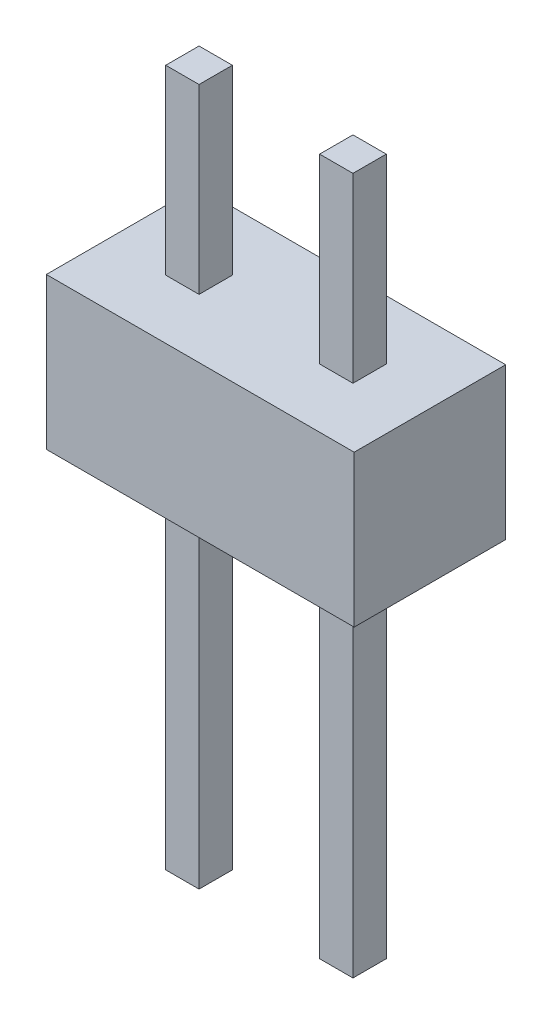
ISO-10303-21;
HEADER;
FILE_DESCRIPTION(('STEP AP214'),'2;1');
FILE_NAME('part.step','',(''),(''),'','','');
FILE_SCHEMA(('AUTOMOTIVE_DESIGN { 1 0 10303 214 1 1 1 1 }'));
ENDSEC;
DATA;
#1=APPLICATION_CONTEXT('core data for automotive mechanical design processes');
#2=APPLICATION_PROTOCOL_DEFINITION('international standard','automotive_design',2000,#1);
#3=PRODUCT_CONTEXT('',#1,'mechanical');
#4=PRODUCT('Part','Part','',(#3));
#5=PRODUCT_RELATED_PRODUCT_CATEGORY('part','',(#4));
#6=PRODUCT_DEFINITION_FORMATION('','',#4);
#7=PRODUCT_DEFINITION_CONTEXT('part definition',#1,'design');
#8=PRODUCT_DEFINITION('design','',#6,#7);
#9=PRODUCT_DEFINITION_SHAPE('','',#8);
#10=(LENGTH_UNIT() NAMED_UNIT(*) SI_UNIT(.MILLI.,.METRE.));
#11=(NAMED_UNIT(*) PLANE_ANGLE_UNIT() SI_UNIT($,.RADIAN.));
#12=(NAMED_UNIT(*) SI_UNIT($,.STERADIAN.) SOLID_ANGLE_UNIT());
#13=UNCERTAINTY_MEASURE_WITH_UNIT(LENGTH_MEASURE(1.E-05),#10,'distance_accuracy_value','');
#14=(GEOMETRIC_REPRESENTATION_CONTEXT(3) GLOBAL_UNCERTAINTY_ASSIGNED_CONTEXT((#13)) GLOBAL_UNIT_ASSIGNED_CONTEXT((#10,
#11,#12)) REPRESENTATION_CONTEXT('',''));
#15=CARTESIAN_POINT('',(0.,0.,0.));
#16=DIRECTION('',(0.,0.,1.));
#17=DIRECTION('',(1.,0.,0.));
#18=AXIS2_PLACEMENT_3D('',#15,#16,#17);
#19=CARTESIAN_POINT('',(4.085,5.5,-0.275));
#20=DIRECTION('',(1.,0.,0.));
#21=DIRECTION('',(0.,0.,-1.));
#22=AXIS2_PLACEMENT_3D('',#19,#20,#21);
#23=PLANE('',#22);
#24=DIRECTION('',(0.,0.,1.));
#25=VECTOR('',#24,1.);
#26=CARTESIAN_POINT('',(4.085,0.,-0.275));
#27=LINE('',#26,#25);
#28=CARTESIAN_POINT('',(4.085,0.,-0.275));
#29=VERTEX_POINT('',#28);
#30=CARTESIAN_POINT('',(4.085,0.,0.275));
#31=VERTEX_POINT('',#30);
#32=EDGE_CURVE('E107',#29,#31,#27,.T.);
#33=ORIENTED_EDGE('',*,*,#32,.F.);
#34=DIRECTION('',(0.,-1.,0.));
#35=VECTOR('',#34,1.);
#36=CARTESIAN_POINT('',(4.085,5.5,-0.275));
#37=LINE('',#36,#35);
#38=CARTESIAN_POINT('',(4.085,5.5,-0.275));
#39=VERTEX_POINT('',#38);
#40=EDGE_CURVE('E12',#39,#29,#37,.T.);
#41=ORIENTED_EDGE('',*,*,#40,.F.);
#42=DIRECTION('',(0.,0.,1.));
#43=VECTOR('',#42,1.);
#44=CARTESIAN_POINT('',(4.085,5.5,-0.275));
#45=LINE('',#44,#43);
#46=CARTESIAN_POINT('',(4.085,5.5,0.275));
#47=VERTEX_POINT('',#46);
#48=EDGE_CURVE('E101',#39,#47,#45,.T.);
#49=ORIENTED_EDGE('',*,*,#48,.T.);
#50=DIRECTION('',(0.,-1.,0.));
#51=VECTOR('',#50,1.);
#52=CARTESIAN_POINT('',(4.085,5.5,0.275));
#53=LINE('',#52,#51);
#54=EDGE_CURVE('E46',#47,#31,#53,.T.);
#55=ORIENTED_EDGE('',*,*,#54,.T.);
#56=EDGE_LOOP('',(#33,#41,#49,#55));
#57=FACE_BOUND('',#56,.T.);
#58=ADVANCED_FACE('F43',(#57),#23,.T.);
#59=CARTESIAN_POINT('',(3.535,5.5,-0.275));
#60=DIRECTION('',(0.,0.,-1.));
#61=DIRECTION('',(-1.,0.,0.));
#62=AXIS2_PLACEMENT_3D('',#59,#60,#61);
#63=PLANE('',#62);
#64=DIRECTION('',(1.,0.,0.));
#65=VECTOR('',#64,1.);
#66=CARTESIAN_POINT('',(3.535,0.,-0.275));
#67=LINE('',#66,#65);
#68=CARTESIAN_POINT('',(3.535,0.,-0.275));
#69=VERTEX_POINT('',#68);
#70=EDGE_CURVE('E103',#69,#29,#67,.T.);
#71=ORIENTED_EDGE('',*,*,#70,.F.);
#72=DIRECTION('',(0.,-1.,0.));
#73=VECTOR('',#72,1.);
#74=CARTESIAN_POINT('',(3.535,5.5,-0.275));
#75=LINE('',#74,#73);
#76=CARTESIAN_POINT('',(3.535,5.5,-0.275));
#77=VERTEX_POINT('',#76);
#78=EDGE_CURVE('E52',#77,#69,#75,.T.);
#79=ORIENTED_EDGE('',*,*,#78,.F.);
#80=DIRECTION('',(1.,0.,0.));
#81=VECTOR('',#80,1.);
#82=CARTESIAN_POINT('',(3.535,5.5,-0.275));
#83=LINE('',#82,#81);
#84=EDGE_CURVE('E98',#77,#39,#83,.T.);
#85=ORIENTED_EDGE('',*,*,#84,.T.);
#86=ORIENTED_EDGE('',*,*,#40,.T.);
#87=EDGE_LOOP('',(#71,#79,#85,#86));
#88=FACE_BOUND('',#87,.T.);
#89=ADVANCED_FACE('F117',(#88),#63,.T.);
#90=CARTESIAN_POINT('',(3.535,5.5,-0.275));
#91=DIRECTION('',(-1.,0.,0.));
#92=DIRECTION('',(0.,0.,1.));
#93=AXIS2_PLACEMENT_3D('',#90,#91,#92);
#94=PLANE('',#93);
#95=DIRECTION('',(0.,0.,-1.));
#96=VECTOR('',#95,1.);
#97=CARTESIAN_POINT('',(3.535,0.,-0.275));
#98=LINE('',#97,#96);
#99=CARTESIAN_POINT('',(3.535,0.,0.275));
#100=VERTEX_POINT('',#99);
#101=EDGE_CURVE('E93',#100,#69,#98,.T.);
#102=ORIENTED_EDGE('',*,*,#101,.F.);
#103=DIRECTION('',(0.,-1.,0.));
#104=VECTOR('',#103,1.);
#105=CARTESIAN_POINT('',(3.535,5.5,0.275));
#106=LINE('',#105,#104);
#107=CARTESIAN_POINT('',(3.535,5.5,0.275));
#108=VERTEX_POINT('',#107);
#109=EDGE_CURVE('E88',#108,#100,#106,.T.);
#110=ORIENTED_EDGE('',*,*,#109,.F.);
#111=DIRECTION('',(0.,0.,-1.));
#112=VECTOR('',#111,1.);
#113=CARTESIAN_POINT('',(3.535,5.5,-0.275));
#114=LINE('',#113,#112);
#115=EDGE_CURVE('E91',#108,#77,#114,.T.);
#116=ORIENTED_EDGE('',*,*,#115,.T.);
#117=ORIENTED_EDGE('',*,*,#78,.T.);
#118=EDGE_LOOP('',(#102,#110,#116,#117));
#119=FACE_BOUND('',#118,.T.);
#120=ADVANCED_FACE('F90',(#119),#94,.T.);
#121=CARTESIAN_POINT('',(3.535,5.5,0.275));
#122=DIRECTION('',(0.,0.,1.));
#123=DIRECTION('',(1.,0.,0.));
#124=AXIS2_PLACEMENT_3D('',#121,#122,#123);
#125=PLANE('',#124);
#126=DIRECTION('',(-1.,0.,0.));
#127=VECTOR('',#126,1.);
#128=CARTESIAN_POINT('',(3.535,0.,0.275));
#129=LINE('',#128,#127);
#130=EDGE_CURVE('E110',#31,#100,#129,.T.);
#131=ORIENTED_EDGE('',*,*,#130,.F.);
#132=ORIENTED_EDGE('',*,*,#54,.F.);
#133=DIRECTION('',(-1.,0.,0.));
#134=VECTOR('',#133,1.);
#135=CARTESIAN_POINT('',(3.535,5.5,0.275));
#136=LINE('',#135,#134);
#137=EDGE_CURVE('E97',#47,#108,#136,.T.);
#138=ORIENTED_EDGE('',*,*,#137,.T.);
#139=ORIENTED_EDGE('',*,*,#109,.T.);
#140=EDGE_LOOP('',(#131,#132,#138,#139));
#141=FACE_BOUND('',#140,.T.);
#142=ADVANCED_FACE('F100',(#141),#125,.T.);
#143=CARTESIAN_POINT('',(0.,5.5,0.));
#144=DIRECTION('',(0.,1.,0.));
#145=DIRECTION('',(0.,0.,1.));
#146=AXIS2_PLACEMENT_3D('',#143,#144,#145);
#147=PLANE('',#146);
#148=ORIENTED_EDGE('',*,*,#48,.F.);
#149=ORIENTED_EDGE('',*,*,#84,.F.);
#150=ORIENTED_EDGE('',*,*,#115,.F.);
#151=ORIENTED_EDGE('',*,*,#137,.F.);
#152=EDGE_LOOP('',(#148,#149,#150,#151));
#153=FACE_BOUND('',#152,.T.);
#154=ADVANCED_FACE('F96',(#153),#147,.T.);
#155=CARTESIAN_POINT('',(0.,0.,0.));
#156=DIRECTION('',(0.,1.,0.));
#157=DIRECTION('',(0.,0.,1.));
#158=AXIS2_PLACEMENT_3D('',#155,#156,#157);
#159=PLANE('',#158);
#160=ORIENTED_EDGE('',*,*,#32,.T.);
#161=ORIENTED_EDGE('',*,*,#130,.T.);
#162=ORIENTED_EDGE('',*,*,#101,.T.);
#163=ORIENTED_EDGE('',*,*,#70,.T.);
#164=EDGE_LOOP('',(#160,#161,#162,#163));
#165=FACE_BOUND('',#164,.T.);
#166=ADVANCED_FACE('F116',(#165),#159,.F.);
#167=CLOSED_SHELL('',(#58,#89,#120,#142,#154,#166));
#168=MANIFOLD_SOLID_BREP('B2',#167);
#169=CARTESIAN_POINT('',(1.545,5.5,-0.275));
#170=DIRECTION('',(1.,0.,0.));
#171=DIRECTION('',(0.,0.,-1.));
#172=AXIS2_PLACEMENT_3D('',#169,#170,#171);
#173=PLANE('',#172);
#174=DIRECTION('',(0.,0.,1.));
#175=VECTOR('',#174,1.);
#176=CARTESIAN_POINT('',(1.545,0.,-0.275));
#177=LINE('',#176,#175);
#178=CARTESIAN_POINT('',(1.545,0.,-0.275));
#179=VERTEX_POINT('',#178);
#180=CARTESIAN_POINT('',(1.545,0.,0.275));
#181=VERTEX_POINT('',#180);
#182=EDGE_CURVE('E240',#179,#181,#177,.T.);
#183=ORIENTED_EDGE('',*,*,#182,.F.);
#184=DIRECTION('',(0.,-1.,0.));
#185=VECTOR('',#184,1.);
#186=CARTESIAN_POINT('',(1.545,5.5,-0.275));
#187=LINE('',#186,#185);
#188=CARTESIAN_POINT('',(1.545,5.5,-0.275));
#189=VERTEX_POINT('',#188);
#190=EDGE_CURVE('E41',#189,#179,#187,.T.);
#191=ORIENTED_EDGE('',*,*,#190,.F.);
#192=DIRECTION('',(0.,0.,1.));
#193=VECTOR('',#192,1.);
#194=CARTESIAN_POINT('',(1.545,5.5,-0.275));
#195=LINE('',#194,#193);
#196=CARTESIAN_POINT('',(1.545,5.5,0.275));
#197=VERTEX_POINT('',#196);
#198=EDGE_CURVE('E234',#189,#197,#195,.T.);
#199=ORIENTED_EDGE('',*,*,#198,.T.);
#200=DIRECTION('',(0.,-1.,0.));
#201=VECTOR('',#200,1.);
#202=CARTESIAN_POINT('',(1.545,5.5,0.275));
#203=LINE('',#202,#201);
#204=EDGE_CURVE('E179',#197,#181,#203,.T.);
#205=ORIENTED_EDGE('',*,*,#204,.T.);
#206=EDGE_LOOP('',(#183,#191,#199,#205));
#207=FACE_BOUND('',#206,.T.);
#208=ADVANCED_FACE('F176',(#207),#173,.T.);
#209=CARTESIAN_POINT('',(0.995,5.5,-0.275));
#210=DIRECTION('',(0.,0.,-1.));
#211=DIRECTION('',(-1.,0.,0.));
#212=AXIS2_PLACEMENT_3D('',#209,#210,#211);
#213=PLANE('',#212);
#214=DIRECTION('',(1.,0.,0.));
#215=VECTOR('',#214,1.);
#216=CARTESIAN_POINT('',(0.995,0.,-0.275));
#217=LINE('',#216,#215);
#218=CARTESIAN_POINT('',(0.995,0.,-0.275));
#219=VERTEX_POINT('',#218);
#220=EDGE_CURVE('E236',#219,#179,#217,.T.);
#221=ORIENTED_EDGE('',*,*,#220,.F.);
#222=DIRECTION('',(0.,-1.,0.));
#223=VECTOR('',#222,1.);
#224=CARTESIAN_POINT('',(0.995,5.5,-0.275));
#225=LINE('',#224,#223);
#226=CARTESIAN_POINT('',(0.995,5.5,-0.275));
#227=VERTEX_POINT('',#226);
#228=EDGE_CURVE('E185',#227,#219,#225,.T.);
#229=ORIENTED_EDGE('',*,*,#228,.F.);
#230=DIRECTION('',(1.,0.,0.));
#231=VECTOR('',#230,1.);
#232=CARTESIAN_POINT('',(0.995,5.5,-0.275));
#233=LINE('',#232,#231);
#234=EDGE_CURVE('E231',#227,#189,#233,.T.);
#235=ORIENTED_EDGE('',*,*,#234,.T.);
#236=ORIENTED_EDGE('',*,*,#190,.T.);
#237=EDGE_LOOP('',(#221,#229,#235,#236));
#238=FACE_BOUND('',#237,.T.);
#239=ADVANCED_FACE('F250',(#238),#213,.T.);
#240=CARTESIAN_POINT('',(0.995,5.5,-0.275));
#241=DIRECTION('',(-1.,0.,0.));
#242=DIRECTION('',(0.,0.,1.));
#243=AXIS2_PLACEMENT_3D('',#240,#241,#242);
#244=PLANE('',#243);
#245=DIRECTION('',(0.,0.,-1.));
#246=VECTOR('',#245,1.);
#247=CARTESIAN_POINT('',(0.995,0.,-0.275));
#248=LINE('',#247,#246);
#249=CARTESIAN_POINT('',(0.995,0.,0.275));
#250=VERTEX_POINT('',#249);
#251=EDGE_CURVE('E226',#250,#219,#248,.T.);
#252=ORIENTED_EDGE('',*,*,#251,.F.);
#253=DIRECTION('',(0.,-1.,0.));
#254=VECTOR('',#253,1.);
#255=CARTESIAN_POINT('',(0.995,5.5,0.275));
#256=LINE('',#255,#254);
#257=CARTESIAN_POINT('',(0.995,5.5,0.275));
#258=VERTEX_POINT('',#257);
#259=EDGE_CURVE('E221',#258,#250,#256,.T.);
#260=ORIENTED_EDGE('',*,*,#259,.F.);
#261=DIRECTION('',(0.,0.,-1.));
#262=VECTOR('',#261,1.);
#263=CARTESIAN_POINT('',(0.995,5.5,-0.275));
#264=LINE('',#263,#262);
#265=EDGE_CURVE('E224',#258,#227,#264,.T.);
#266=ORIENTED_EDGE('',*,*,#265,.T.);
#267=ORIENTED_EDGE('',*,*,#228,.T.);
#268=EDGE_LOOP('',(#252,#260,#266,#267));
#269=FACE_BOUND('',#268,.T.);
#270=ADVANCED_FACE('F223',(#269),#244,.T.);
#271=CARTESIAN_POINT('',(0.995,5.5,0.275));
#272=DIRECTION('',(0.,0.,1.));
#273=DIRECTION('',(1.,0.,0.));
#274=AXIS2_PLACEMENT_3D('',#271,#272,#273);
#275=PLANE('',#274);
#276=DIRECTION('',(-1.,0.,0.));
#277=VECTOR('',#276,1.);
#278=CARTESIAN_POINT('',(0.995,0.,0.275));
#279=LINE('',#278,#277);
#280=EDGE_CURVE('E243',#181,#250,#279,.T.);
#281=ORIENTED_EDGE('',*,*,#280,.F.);
#282=ORIENTED_EDGE('',*,*,#204,.F.);
#283=DIRECTION('',(-1.,0.,0.));
#284=VECTOR('',#283,1.);
#285=CARTESIAN_POINT('',(0.995,5.5,0.275));
#286=LINE('',#285,#284);
#287=EDGE_CURVE('E230',#197,#258,#286,.T.);
#288=ORIENTED_EDGE('',*,*,#287,.T.);
#289=ORIENTED_EDGE('',*,*,#259,.T.);
#290=EDGE_LOOP('',(#281,#282,#288,#289));
#291=FACE_BOUND('',#290,.T.);
#292=ADVANCED_FACE('F233',(#291),#275,.T.);
#293=CARTESIAN_POINT('',(0.,5.5,0.));
#294=DIRECTION('',(0.,1.,0.));
#295=DIRECTION('',(0.,0.,1.));
#296=AXIS2_PLACEMENT_3D('',#293,#294,#295);
#297=PLANE('',#296);
#298=ORIENTED_EDGE('',*,*,#198,.F.);
#299=ORIENTED_EDGE('',*,*,#234,.F.);
#300=ORIENTED_EDGE('',*,*,#265,.F.);
#301=ORIENTED_EDGE('',*,*,#287,.F.);
#302=EDGE_LOOP('',(#298,#299,#300,#301));
#303=FACE_BOUND('',#302,.T.);
#304=ADVANCED_FACE('F229',(#303),#297,.T.);
#305=CARTESIAN_POINT('',(0.,0.,0.));
#306=DIRECTION('',(0.,1.,0.));
#307=DIRECTION('',(0.,0.,1.));
#308=AXIS2_PLACEMENT_3D('',#305,#306,#307);
#309=PLANE('',#308);
#310=ORIENTED_EDGE('',*,*,#182,.T.);
#311=ORIENTED_EDGE('',*,*,#280,.T.);
#312=ORIENTED_EDGE('',*,*,#251,.T.);
#313=ORIENTED_EDGE('',*,*,#220,.T.);
#314=EDGE_LOOP('',(#310,#311,#312,#313));
#315=FACE_BOUND('',#314,.T.);
#316=ADVANCED_FACE('F249',(#315),#309,.F.);
#317=CLOSED_SHELL('',(#208,#239,#270,#292,#304,#316));
#318=MANIFOLD_SOLID_BREP('B6',#317);
#319=CARTESIAN_POINT('',(4.085,-6.,-0.275));
#320=DIRECTION('',(-1.,0.,0.));
#321=DIRECTION('',(0.,0.,1.));
#322=AXIS2_PLACEMENT_3D('',#319,#320,#321);
#323=PLANE('',#322);
#324=DIRECTION('',(0.,0.,1.));
#325=VECTOR('',#324,1.);
#326=CARTESIAN_POINT('',(4.085,0.,-0.275));
#327=LINE('',#326,#325);
#328=CARTESIAN_POINT('',(4.085,0.,-0.275));
#329=VERTEX_POINT('',#328);
#330=CARTESIAN_POINT('',(4.085,0.,0.275));
#331=VERTEX_POINT('',#330);
#332=EDGE_CURVE('E372',#329,#331,#327,.T.);
#333=ORIENTED_EDGE('',*,*,#332,.T.);
#334=DIRECTION('',(0.,1.,0.));
#335=VECTOR('',#334,1.);
#336=CARTESIAN_POINT('',(4.085,-6.,0.275));
#337=LINE('',#336,#335);
#338=CARTESIAN_POINT('',(4.085,-6.,0.275));
#339=VERTEX_POINT('',#338);
#340=EDGE_CURVE('E174',#339,#331,#337,.T.);
#341=ORIENTED_EDGE('',*,*,#340,.F.);
#342=DIRECTION('',(0.,0.,1.));
#343=VECTOR('',#342,1.);
#344=CARTESIAN_POINT('',(4.085,-6.,-0.275));
#345=LINE('',#344,#343);
#346=CARTESIAN_POINT('',(4.085,-6.,-0.275));
#347=VERTEX_POINT('',#346);
#348=EDGE_CURVE('E360',#347,#339,#345,.T.);
#349=ORIENTED_EDGE('',*,*,#348,.F.);
#350=DIRECTION('',(0.,1.,0.));
#351=VECTOR('',#350,1.);
#352=CARTESIAN_POINT('',(4.085,-6.,-0.275));
#353=LINE('',#352,#351);
#354=EDGE_CURVE('E368',#347,#329,#353,.T.);
#355=ORIENTED_EDGE('',*,*,#354,.T.);
#356=EDGE_LOOP('',(#333,#341,#349,#355));
#357=FACE_BOUND('',#356,.T.);
#358=ADVANCED_FACE('F309',(#357),#323,.F.);
#359=CARTESIAN_POINT('',(3.535,-6.,0.275));
#360=DIRECTION('',(0.,0.,-1.));
#361=DIRECTION('',(-1.,0.,0.));
#362=AXIS2_PLACEMENT_3D('',#359,#360,#361);
#363=PLANE('',#362);
#364=DIRECTION('',(-1.,0.,0.));
#365=VECTOR('',#364,1.);
#366=CARTESIAN_POINT('',(3.535,0.,0.275));
#367=LINE('',#366,#365);
#368=CARTESIAN_POINT('',(3.535,0.,0.275));
#369=VERTEX_POINT('',#368);
#370=EDGE_CURVE('E364',#331,#369,#367,.T.);
#371=ORIENTED_EDGE('',*,*,#370,.T.);
#372=DIRECTION('',(0.,1.,0.));
#373=VECTOR('',#372,1.);
#374=CARTESIAN_POINT('',(3.535,-6.,0.275));
#375=LINE('',#374,#373);
#376=CARTESIAN_POINT('',(3.535,-6.,0.275));
#377=VERTEX_POINT('',#376);
#378=EDGE_CURVE('E317',#377,#369,#375,.T.);
#379=ORIENTED_EDGE('',*,*,#378,.F.);
#380=DIRECTION('',(-1.,0.,0.));
#381=VECTOR('',#380,1.);
#382=CARTESIAN_POINT('',(3.535,-6.,0.275));
#383=LINE('',#382,#381);
#384=EDGE_CURVE('E355',#339,#377,#383,.T.);
#385=ORIENTED_EDGE('',*,*,#384,.F.);
#386=ORIENTED_EDGE('',*,*,#340,.T.);
#387=EDGE_LOOP('',(#371,#379,#385,#386));
#388=FACE_BOUND('',#387,.T.);
#389=ADVANCED_FACE('F363',(#388),#363,.F.);
#390=CARTESIAN_POINT('',(3.535,-6.,-0.275));
#391=DIRECTION('',(1.,0.,0.));
#392=DIRECTION('',(0.,0.,-1.));
#393=AXIS2_PLACEMENT_3D('',#390,#391,#392);
#394=PLANE('',#393);
#395=DIRECTION('',(0.,0.,-1.));
#396=VECTOR('',#395,1.);
#397=CARTESIAN_POINT('',(3.535,0.,-0.275));
#398=LINE('',#397,#396);
#399=CARTESIAN_POINT('',(3.535,0.,-0.275));
#400=VERTEX_POINT('',#399);
#401=EDGE_CURVE('E342',#369,#400,#398,.T.);
#402=ORIENTED_EDGE('',*,*,#401,.T.);
#403=DIRECTION('',(0.,1.,0.));
#404=VECTOR('',#403,1.);
#405=CARTESIAN_POINT('',(3.535,-6.,-0.275));
#406=LINE('',#405,#404);
#407=CARTESIAN_POINT('',(3.535,-6.,-0.275));
#408=VERTEX_POINT('',#407);
#409=EDGE_CURVE('E365',#408,#400,#406,.T.);
#410=ORIENTED_EDGE('',*,*,#409,.F.);
#411=DIRECTION('',(0.,0.,-1.));
#412=VECTOR('',#411,1.);
#413=CARTESIAN_POINT('',(3.535,-6.,-0.275));
#414=LINE('',#413,#412);
#415=EDGE_CURVE('E358',#377,#408,#414,.T.);
#416=ORIENTED_EDGE('',*,*,#415,.F.);
#417=ORIENTED_EDGE('',*,*,#378,.T.);
#418=EDGE_LOOP('',(#402,#410,#416,#417));
#419=FACE_BOUND('',#418,.T.);
#420=ADVANCED_FACE('F366',(#419),#394,.F.);
#421=CARTESIAN_POINT('',(3.535,-6.,-0.275));
#422=DIRECTION('',(0.,0.,1.));
#423=DIRECTION('',(1.,0.,0.));
#424=AXIS2_PLACEMENT_3D('',#421,#422,#423);
#425=PLANE('',#424);
#426=DIRECTION('',(1.,0.,0.));
#427=VECTOR('',#426,1.);
#428=CARTESIAN_POINT('',(3.535,0.,-0.275));
#429=LINE('',#428,#427);
#430=EDGE_CURVE('E348',#400,#329,#429,.T.);
#431=ORIENTED_EDGE('',*,*,#430,.T.);
#432=ORIENTED_EDGE('',*,*,#354,.F.);
#433=DIRECTION('',(1.,0.,0.));
#434=VECTOR('',#433,1.);
#435=CARTESIAN_POINT('',(3.535,-6.,-0.275));
#436=LINE('',#435,#434);
#437=EDGE_CURVE('E325',#408,#347,#436,.T.);
#438=ORIENTED_EDGE('',*,*,#437,.F.);
#439=ORIENTED_EDGE('',*,*,#409,.T.);
#440=EDGE_LOOP('',(#431,#432,#438,#439));
#441=FACE_BOUND('',#440,.T.);
#442=ADVANCED_FACE('F379',(#441),#425,.F.);
#443=CARTESIAN_POINT('',(0.,-6.,0.));
#444=DIRECTION('',(0.,1.,0.));
#445=DIRECTION('',(0.,0.,1.));
#446=AXIS2_PLACEMENT_3D('',#443,#444,#445);
#447=PLANE('',#446);
#448=ORIENTED_EDGE('',*,*,#348,.T.);
#449=ORIENTED_EDGE('',*,*,#384,.T.);
#450=ORIENTED_EDGE('',*,*,#415,.T.);
#451=ORIENTED_EDGE('',*,*,#437,.T.);
#452=EDGE_LOOP('',(#448,#449,#450,#451));
#453=FACE_BOUND('',#452,.T.);
#454=ADVANCED_FACE('F356',(#453),#447,.F.);
#455=CARTESIAN_POINT('',(0.,0.,0.));
#456=DIRECTION('',(0.,1.,0.));
#457=DIRECTION('',(0.,0.,1.));
#458=AXIS2_PLACEMENT_3D('',#455,#456,#457);
#459=PLANE('',#458);
#460=ORIENTED_EDGE('',*,*,#332,.F.);
#461=ORIENTED_EDGE('',*,*,#430,.F.);
#462=ORIENTED_EDGE('',*,*,#401,.F.);
#463=ORIENTED_EDGE('',*,*,#370,.F.);
#464=EDGE_LOOP('',(#460,#461,#462,#463));
#465=FACE_BOUND('',#464,.T.);
#466=ADVANCED_FACE('F382',(#465),#459,.T.);
#467=CLOSED_SHELL('',(#358,#389,#420,#442,#454,#466));
#468=MANIFOLD_SOLID_BREP('B35',#467);
#469=CARTESIAN_POINT('',(1.545,-6.,-0.275));
#470=DIRECTION('',(-1.,0.,0.));
#471=DIRECTION('',(0.,0.,1.));
#472=AXIS2_PLACEMENT_3D('',#469,#470,#471);
#473=PLANE('',#472);
#474=DIRECTION('',(0.,0.,1.));
#475=VECTOR('',#474,1.);
#476=CARTESIAN_POINT('',(1.545,0.,-0.275));
#477=LINE('',#476,#475);
#478=CARTESIAN_POINT('',(1.545,0.,-0.275));
#479=VERTEX_POINT('',#478);
#480=CARTESIAN_POINT('',(1.545,0.,0.275));
#481=VERTEX_POINT('',#480);
#482=EDGE_CURVE('E504',#479,#481,#477,.T.);
#483=ORIENTED_EDGE('',*,*,#482,.T.);
#484=DIRECTION('',(0.,1.,0.));
#485=VECTOR('',#484,1.);
#486=CARTESIAN_POINT('',(1.545,-6.,0.275));
#487=LINE('',#486,#485);
#488=CARTESIAN_POINT('',(1.545,-6.,0.275));
#489=VERTEX_POINT('',#488);
#490=EDGE_CURVE('E307',#489,#481,#487,.T.);
#491=ORIENTED_EDGE('',*,*,#490,.F.);
#492=DIRECTION('',(0.,0.,1.));
#493=VECTOR('',#492,1.);
#494=CARTESIAN_POINT('',(1.545,-6.,-0.275));
#495=LINE('',#494,#493);
#496=CARTESIAN_POINT('',(1.545,-6.,-0.275));
#497=VERTEX_POINT('',#496);
#498=EDGE_CURVE('E492',#497,#489,#495,.T.);
#499=ORIENTED_EDGE('',*,*,#498,.F.);
#500=DIRECTION('',(0.,1.,0.));
#501=VECTOR('',#500,1.);
#502=CARTESIAN_POINT('',(1.545,-6.,-0.275));
#503=LINE('',#502,#501);
#504=EDGE_CURVE('E500',#497,#479,#503,.T.);
#505=ORIENTED_EDGE('',*,*,#504,.T.);
#506=EDGE_LOOP('',(#483,#491,#499,#505));
#507=FACE_BOUND('',#506,.T.);
#508=ADVANCED_FACE('F441',(#507),#473,.F.);
#509=CARTESIAN_POINT('',(0.995,-6.,0.275));
#510=DIRECTION('',(0.,0.,-1.));
#511=DIRECTION('',(-1.,0.,0.));
#512=AXIS2_PLACEMENT_3D('',#509,#510,#511);
#513=PLANE('',#512);
#514=DIRECTION('',(-1.,0.,0.));
#515=VECTOR('',#514,1.);
#516=CARTESIAN_POINT('',(0.995,0.,0.275));
#517=LINE('',#516,#515);
#518=CARTESIAN_POINT('',(0.995,0.,0.275));
#519=VERTEX_POINT('',#518);
#520=EDGE_CURVE('E496',#481,#519,#517,.T.);
#521=ORIENTED_EDGE('',*,*,#520,.T.);
#522=DIRECTION('',(0.,1.,0.));
#523=VECTOR('',#522,1.);
#524=CARTESIAN_POINT('',(0.995,-6.,0.275));
#525=LINE('',#524,#523);
#526=CARTESIAN_POINT('',(0.995,-6.,0.275));
#527=VERTEX_POINT('',#526);
#528=EDGE_CURVE('E449',#527,#519,#525,.T.);
#529=ORIENTED_EDGE('',*,*,#528,.F.);
#530=DIRECTION('',(-1.,0.,0.));
#531=VECTOR('',#530,1.);
#532=CARTESIAN_POINT('',(0.995,-6.,0.275));
#533=LINE('',#532,#531);
#534=EDGE_CURVE('E487',#489,#527,#533,.T.);
#535=ORIENTED_EDGE('',*,*,#534,.F.);
#536=ORIENTED_EDGE('',*,*,#490,.T.);
#537=EDGE_LOOP('',(#521,#529,#535,#536));
#538=FACE_BOUND('',#537,.T.);
#539=ADVANCED_FACE('F495',(#538),#513,.F.);
#540=CARTESIAN_POINT('',(0.995,-6.,-0.275));
#541=DIRECTION('',(1.,0.,0.));
#542=DIRECTION('',(0.,0.,-1.));
#543=AXIS2_PLACEMENT_3D('',#540,#541,#542);
#544=PLANE('',#543);
#545=DIRECTION('',(0.,0.,-1.));
#546=VECTOR('',#545,1.);
#547=CARTESIAN_POINT('',(0.995,0.,-0.275));
#548=LINE('',#547,#546);
#549=CARTESIAN_POINT('',(0.995,0.,-0.275));
#550=VERTEX_POINT('',#549);
#551=EDGE_CURVE('E474',#519,#550,#548,.T.);
#552=ORIENTED_EDGE('',*,*,#551,.T.);
#553=DIRECTION('',(0.,1.,0.));
#554=VECTOR('',#553,1.);
#555=CARTESIAN_POINT('',(0.995,-6.,-0.275));
#556=LINE('',#555,#554);
#557=CARTESIAN_POINT('',(0.995,-6.,-0.275));
#558=VERTEX_POINT('',#557);
#559=EDGE_CURVE('E497',#558,#550,#556,.T.);
#560=ORIENTED_EDGE('',*,*,#559,.F.);
#561=DIRECTION('',(0.,0.,-1.));
#562=VECTOR('',#561,1.);
#563=CARTESIAN_POINT('',(0.995,-6.,-0.275));
#564=LINE('',#563,#562);
#565=EDGE_CURVE('E490',#527,#558,#564,.T.);
#566=ORIENTED_EDGE('',*,*,#565,.F.);
#567=ORIENTED_EDGE('',*,*,#528,.T.);
#568=EDGE_LOOP('',(#552,#560,#566,#567));
#569=FACE_BOUND('',#568,.T.);
#570=ADVANCED_FACE('F498',(#569),#544,.F.);
#571=CARTESIAN_POINT('',(0.995,-6.,-0.275));
#572=DIRECTION('',(0.,0.,1.));
#573=DIRECTION('',(1.,0.,0.));
#574=AXIS2_PLACEMENT_3D('',#571,#572,#573);
#575=PLANE('',#574);
#576=DIRECTION('',(1.,0.,0.));
#577=VECTOR('',#576,1.);
#578=CARTESIAN_POINT('',(0.995,0.,-0.275));
#579=LINE('',#578,#577);
#580=EDGE_CURVE('E480',#550,#479,#579,.T.);
#581=ORIENTED_EDGE('',*,*,#580,.T.);
#582=ORIENTED_EDGE('',*,*,#504,.F.);
#583=DIRECTION('',(1.,0.,0.));
#584=VECTOR('',#583,1.);
#585=CARTESIAN_POINT('',(0.995,-6.,-0.275));
#586=LINE('',#585,#584);
#587=EDGE_CURVE('E457',#558,#497,#586,.T.);
#588=ORIENTED_EDGE('',*,*,#587,.F.);
#589=ORIENTED_EDGE('',*,*,#559,.T.);
#590=EDGE_LOOP('',(#581,#582,#588,#589));
#591=FACE_BOUND('',#590,.T.);
#592=ADVANCED_FACE('F511',(#591),#575,.F.);
#593=CARTESIAN_POINT('',(0.,-6.,0.));
#594=DIRECTION('',(0.,1.,0.));
#595=DIRECTION('',(0.,0.,1.));
#596=AXIS2_PLACEMENT_3D('',#593,#594,#595);
#597=PLANE('',#596);
#598=ORIENTED_EDGE('',*,*,#498,.T.);
#599=ORIENTED_EDGE('',*,*,#534,.T.);
#600=ORIENTED_EDGE('',*,*,#565,.T.);
#601=ORIENTED_EDGE('',*,*,#587,.T.);
#602=EDGE_LOOP('',(#598,#599,#600,#601));
#603=FACE_BOUND('',#602,.T.);
#604=ADVANCED_FACE('F488',(#603),#597,.F.);
#605=CARTESIAN_POINT('',(0.,0.,0.));
#606=DIRECTION('',(0.,1.,0.));
#607=DIRECTION('',(0.,0.,1.));
#608=AXIS2_PLACEMENT_3D('',#605,#606,#607);
#609=PLANE('',#608);
#610=ORIENTED_EDGE('',*,*,#482,.F.);
#611=ORIENTED_EDGE('',*,*,#580,.F.);
#612=ORIENTED_EDGE('',*,*,#551,.F.);
#613=ORIENTED_EDGE('',*,*,#520,.F.);
#614=EDGE_LOOP('',(#610,#611,#612,#613));
#615=FACE_BOUND('',#614,.T.);
#616=ADVANCED_FACE('F514',(#615),#609,.T.);
#617=CLOSED_SHELL('',(#508,#539,#570,#592,#604,#616));
#618=MANIFOLD_SOLID_BREP('B168',#617);
#619=CARTESIAN_POINT('',(0.,0.,1.25));
#620=DIRECTION('',(1.,0.,0.));
#621=DIRECTION('',(0.,0.,-1.));
#622=AXIS2_PLACEMENT_3D('',#619,#620,#621);
#623=PLANE('',#622);
#624=DIRECTION('',(0.,-1.,0.));
#625=VECTOR('',#624,1.);
#626=CARTESIAN_POINT('',(0.,0.,-1.25));
#627=LINE('',#626,#625);
#628=CARTESIAN_POINT('',(0.,2.5,-1.25));
#629=VERTEX_POINT('',#628);
#630=CARTESIAN_POINT('',(0.,0.,-1.25));
#631=VERTEX_POINT('',#630);
#632=EDGE_CURVE('E627',#629,#631,#627,.T.);
#633=ORIENTED_EDGE('',*,*,#632,.T.);
#634=DIRECTION('',(0.,0.,-1.));
#635=VECTOR('',#634,1.);
#636=CARTESIAN_POINT('',(0.,0.,1.25));
#637=LINE('',#636,#635);
#638=CARTESIAN_POINT('',(0.,0.,1.25));
#639=VERTEX_POINT('',#638);
#640=EDGE_CURVE('E439',#639,#631,#637,.T.);
#641=ORIENTED_EDGE('',*,*,#640,.F.);
#642=DIRECTION('',(0.,-1.,0.));
#643=VECTOR('',#642,1.);
#644=CARTESIAN_POINT('',(0.,0.,1.25));
#645=LINE('',#644,#643);
#646=CARTESIAN_POINT('',(0.,2.5,1.25));
#647=VERTEX_POINT('',#646);
#648=EDGE_CURVE('E615',#647,#639,#645,.T.);
#649=ORIENTED_EDGE('',*,*,#648,.F.);
#650=DIRECTION('',(0.,0.,-1.));
#651=VECTOR('',#650,1.);
#652=CARTESIAN_POINT('',(0.,2.5,1.25));
#653=LINE('',#652,#651);
#654=EDGE_CURVE('E623',#647,#629,#653,.T.);
#655=ORIENTED_EDGE('',*,*,#654,.T.);
#656=EDGE_LOOP('',(#633,#641,#649,#655));
#657=FACE_BOUND('',#656,.T.);
#658=ADVANCED_FACE('F564',(#657),#623,.F.);
#659=CARTESIAN_POINT('',(0.,0.,1.25));
#660=DIRECTION('',(0.,1.,0.));
#661=DIRECTION('',(0.,0.,1.));
#662=AXIS2_PLACEMENT_3D('',#659,#660,#661);
#663=PLANE('',#662);
#664=DIRECTION('',(1.,0.,0.));
#665=VECTOR('',#664,1.);
#666=CARTESIAN_POINT('',(0.,0.,-1.25));
#667=LINE('',#666,#665);
#668=CARTESIAN_POINT('',(5.08,0.,-1.25));
#669=VERTEX_POINT('',#668);
#670=EDGE_CURVE('E619',#631,#669,#667,.T.);
#671=ORIENTED_EDGE('',*,*,#670,.T.);
#672=DIRECTION('',(0.,0.,-1.));
#673=VECTOR('',#672,1.);
#674=CARTESIAN_POINT('',(5.08,0.,1.25));
#675=LINE('',#674,#673);
#676=CARTESIAN_POINT('',(5.08,0.,1.25));
#677=VERTEX_POINT('',#676);
#678=EDGE_CURVE('E572',#677,#669,#675,.T.);
#679=ORIENTED_EDGE('',*,*,#678,.F.);
#680=DIRECTION('',(1.,0.,0.));
#681=VECTOR('',#680,1.);
#682=CARTESIAN_POINT('',(0.,0.,1.25));
#683=LINE('',#682,#681);
#684=EDGE_CURVE('E610',#639,#677,#683,.T.);
#685=ORIENTED_EDGE('',*,*,#684,.F.);
#686=ORIENTED_EDGE('',*,*,#640,.T.);
#687=EDGE_LOOP('',(#671,#679,#685,#686));
#688=FACE_BOUND('',#687,.T.);
#689=ADVANCED_FACE('F618',(#688),#663,.F.);
#690=CARTESIAN_POINT('',(5.08,0.,1.25));
#691=DIRECTION('',(-1.,0.,0.));
#692=DIRECTION('',(0.,0.,1.));
#693=AXIS2_PLACEMENT_3D('',#690,#691,#692);
#694=PLANE('',#693);
#695=DIRECTION('',(0.,1.,0.));
#696=VECTOR('',#695,1.);
#697=CARTESIAN_POINT('',(5.08,0.,-1.25));
#698=LINE('',#697,#696);
#699=CARTESIAN_POINT('',(5.08,2.5,-1.25));
#700=VERTEX_POINT('',#699);
#701=EDGE_CURVE('E597',#669,#700,#698,.T.);
#702=ORIENTED_EDGE('',*,*,#701,.T.);
#703=DIRECTION('',(0.,0.,-1.));
#704=VECTOR('',#703,1.);
#705=CARTESIAN_POINT('',(5.08,2.5,1.25));
#706=LINE('',#705,#704);
#707=CARTESIAN_POINT('',(5.08,2.5,1.25));
#708=VERTEX_POINT('',#707);
#709=EDGE_CURVE('E620',#708,#700,#706,.T.);
#710=ORIENTED_EDGE('',*,*,#709,.F.);
#711=DIRECTION('',(0.,1.,0.));
#712=VECTOR('',#711,1.);
#713=CARTESIAN_POINT('',(5.08,0.,1.25));
#714=LINE('',#713,#712);
#715=EDGE_CURVE('E613',#677,#708,#714,.T.);
#716=ORIENTED_EDGE('',*,*,#715,.F.);
#717=ORIENTED_EDGE('',*,*,#678,.T.);
#718=EDGE_LOOP('',(#702,#710,#716,#717));
#719=FACE_BOUND('',#718,.T.);
#720=ADVANCED_FACE('F621',(#719),#694,.F.);
#721=CARTESIAN_POINT('',(0.,2.5,1.25));
#722=DIRECTION('',(0.,-1.,0.));
#723=DIRECTION('',(0.,0.,-1.));
#724=AXIS2_PLACEMENT_3D('',#721,#722,#723);
#725=PLANE('',#724);
#726=DIRECTION('',(-1.,0.,0.));
#727=VECTOR('',#726,1.);
#728=CARTESIAN_POINT('',(0.,2.5,-1.25));
#729=LINE('',#728,#727);
#730=EDGE_CURVE('E603',#700,#629,#729,.T.);
#731=ORIENTED_EDGE('',*,*,#730,.T.);
#732=ORIENTED_EDGE('',*,*,#654,.F.);
#733=DIRECTION('',(-1.,0.,0.));
#734=VECTOR('',#733,1.);
#735=CARTESIAN_POINT('',(0.,2.5,1.25));
#736=LINE('',#735,#734);
#737=EDGE_CURVE('E580',#708,#647,#736,.T.);
#738=ORIENTED_EDGE('',*,*,#737,.F.);
#739=ORIENTED_EDGE('',*,*,#709,.T.);
#740=EDGE_LOOP('',(#731,#732,#738,#739));
#741=FACE_BOUND('',#740,.T.);
#742=ADVANCED_FACE('F634',(#741),#725,.F.);
#743=CARTESIAN_POINT('',(0.,0.,1.25));
#744=DIRECTION('',(0.,0.,-1.));
#745=DIRECTION('',(-1.,0.,0.));
#746=AXIS2_PLACEMENT_3D('',#743,#744,#745);
#747=PLANE('',#746);
#748=ORIENTED_EDGE('',*,*,#648,.T.);
#749=ORIENTED_EDGE('',*,*,#684,.T.);
#750=ORIENTED_EDGE('',*,*,#715,.T.);
#751=ORIENTED_EDGE('',*,*,#737,.T.);
#752=EDGE_LOOP('',(#748,#749,#750,#751));
#753=FACE_BOUND('',#752,.T.);
#754=ADVANCED_FACE('F611',(#753),#747,.F.);
#755=CARTESIAN_POINT('',(0.,0.,-1.25));
#756=DIRECTION('',(0.,0.,-1.));
#757=DIRECTION('',(-1.,0.,0.));
#758=AXIS2_PLACEMENT_3D('',#755,#756,#757);
#759=PLANE('',#758);
#760=ORIENTED_EDGE('',*,*,#632,.F.);
#761=ORIENTED_EDGE('',*,*,#730,.F.);
#762=ORIENTED_EDGE('',*,*,#701,.F.);
#763=ORIENTED_EDGE('',*,*,#670,.F.);
#764=EDGE_LOOP('',(#760,#761,#762,#763));
#765=FACE_BOUND('',#764,.T.);
#766=ADVANCED_FACE('F637',(#765),#759,.T.);
#767=CLOSED_SHELL('',(#658,#689,#720,#742,#754,#766));
#768=MANIFOLD_SOLID_BREP('B301',#767);
#769=ADVANCED_BREP_SHAPE_REPRESENTATION('',(#18,#168,#318,#468,#618,#768),#14);
#770=SHAPE_DEFINITION_REPRESENTATION(#9,#769);
ENDSEC;
END-ISO-10303-21;
